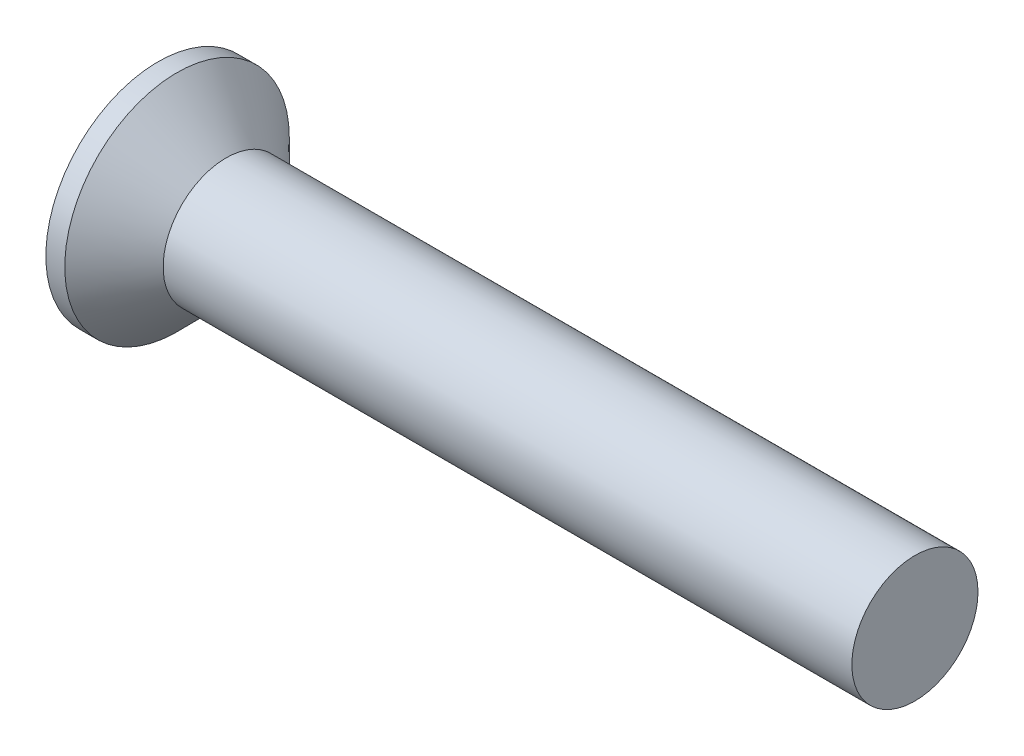
ISO-10303-21;
HEADER;
FILE_DESCRIPTION(('STEP AP214'),'2;1');
FILE_NAME('part.step','',(''),(''),'','','');
FILE_SCHEMA(('AUTOMOTIVE_DESIGN { 1 0 10303 214 1 1 1 1 }'));
ENDSEC;
DATA;
#1=APPLICATION_CONTEXT('core data for automotive mechanical design processes');
#2=APPLICATION_PROTOCOL_DEFINITION('international standard','automotive_design',2000,#1);
#3=PRODUCT_CONTEXT('',#1,'mechanical');
#4=PRODUCT('Part','Part','',(#3));
#5=PRODUCT_RELATED_PRODUCT_CATEGORY('part','',(#4));
#6=PRODUCT_DEFINITION_FORMATION('','',#4);
#7=PRODUCT_DEFINITION_CONTEXT('part definition',#1,'design');
#8=PRODUCT_DEFINITION('design','',#6,#7);
#9=PRODUCT_DEFINITION_SHAPE('','',#8);
#10=(LENGTH_UNIT() NAMED_UNIT(*) SI_UNIT(.MILLI.,.METRE.));
#11=(NAMED_UNIT(*) PLANE_ANGLE_UNIT() SI_UNIT($,.RADIAN.));
#12=(NAMED_UNIT(*) SI_UNIT($,.STERADIAN.) SOLID_ANGLE_UNIT());
#13=UNCERTAINTY_MEASURE_WITH_UNIT(LENGTH_MEASURE(1.E-05),#10,'distance_accuracy_value','');
#14=(GEOMETRIC_REPRESENTATION_CONTEXT(3) GLOBAL_UNCERTAINTY_ASSIGNED_CONTEXT((#13)) GLOBAL_UNIT_ASSIGNED_CONTEXT((#10,
#11,#12)) REPRESENTATION_CONTEXT('',''));
#15=CARTESIAN_POINT('',(0.,0.,0.));
#16=DIRECTION('',(0.,0.,1.));
#17=DIRECTION('',(1.,0.,0.));
#18=AXIS2_PLACEMENT_3D('',#15,#16,#17);
#19=CARTESIAN_POINT('',(0.,4.45,0.));
#20=DIRECTION('',(-1.,0.,0.));
#21=DIRECTION('',(0.,0.,1.));
#22=AXIS2_PLACEMENT_3D('',#19,#20,#21);
#23=PLANE('',#22);
#24=CARTESIAN_POINT('',(0.,0.,0.));
#25=DIRECTION('',(1.,0.,0.));
#26=DIRECTION('',(0.,0.,-1.));
#27=AXIS2_PLACEMENT_3D('',#24,#25,#26);
#28=CIRCLE('',#27,4.45);
#29=CARTESIAN_POINT('',(0.,0.,-4.45));
#30=VERTEX_POINT('',#29);
#31=EDGE_CURVE('E183',#30,#30,#28,.T.);
#32=ORIENTED_EDGE('',*,*,#31,.F.);
#33=EDGE_LOOP('',(#32));
#34=FACE_BOUND('',#33,.T.);
#35=DIRECTION('',(0.,1.,0.));
#36=VECTOR('',#35,1.);
#37=CARTESIAN_POINT('',(0.,-0.52,-0.52));
#38=LINE('',#37,#36);
#39=CARTESIAN_POINT('',(0.,-2.6,-0.52));
#40=VERTEX_POINT('',#39);
#41=CARTESIAN_POINT('',(0.,-0.82,-0.52));
#42=VERTEX_POINT('',#41);
#43=EDGE_CURVE('E287',#40,#42,#38,.T.);
#44=ORIENTED_EDGE('',*,*,#43,.T.);
#45=CARTESIAN_POINT('',(0.,-0.82,-0.82));
#46=DIRECTION('',(-1.,0.,0.));
#47=DIRECTION('',(0.,0.,1.));
#48=AXIS2_PLACEMENT_3D('',#45,#46,#47);
#49=CIRCLE('',#48,0.3);
#50=CARTESIAN_POINT('',(0.,-0.52,-0.82));
#51=VERTEX_POINT('',#50);
#52=EDGE_CURVE('E189',#42,#51,#49,.T.);
#53=ORIENTED_EDGE('',*,*,#52,.T.);
#54=DIRECTION('',(0.,0.,-1.));
#55=VECTOR('',#54,1.);
#56=CARTESIAN_POINT('',(0.,-0.52,-0.52));
#57=LINE('',#56,#55);
#58=CARTESIAN_POINT('',(0.,-0.52,-2.6));
#59=VERTEX_POINT('',#58);
#60=EDGE_CURVE('E282',#51,#59,#57,.T.);
#61=ORIENTED_EDGE('',*,*,#60,.T.);
#62=DIRECTION('',(0.,1.,0.));
#63=VECTOR('',#62,1.);
#64=CARTESIAN_POINT('',(0.,0.52,-2.6));
#65=LINE('',#64,#63);
#66=CARTESIAN_POINT('',(0.,0.52,-2.6));
#67=VERTEX_POINT('',#66);
#68=EDGE_CURVE('E246',#59,#67,#65,.T.);
#69=ORIENTED_EDGE('',*,*,#68,.T.);
#70=DIRECTION('',(0.,0.,1.));
#71=VECTOR('',#70,1.);
#72=CARTESIAN_POINT('',(0.,0.52,-0.52));
#73=LINE('',#72,#71);
#74=CARTESIAN_POINT('',(0.,0.52,-0.82));
#75=VERTEX_POINT('',#74);
#76=EDGE_CURVE('E236',#67,#75,#73,.T.);
#77=ORIENTED_EDGE('',*,*,#76,.T.);
#78=CARTESIAN_POINT('',(0.,0.82,-0.82));
#79=DIRECTION('',(-1.,0.,0.));
#80=DIRECTION('',(0.,0.,1.));
#81=AXIS2_PLACEMENT_3D('',#78,#79,#80);
#82=CIRCLE('',#81,0.3);
#83=CARTESIAN_POINT('',(0.,0.82,-0.52));
#84=VERTEX_POINT('',#83);
#85=EDGE_CURVE('E185',#75,#84,#82,.T.);
#86=ORIENTED_EDGE('',*,*,#85,.T.);
#87=DIRECTION('',(0.,1.,0.));
#88=VECTOR('',#87,1.);
#89=CARTESIAN_POINT('',(0.,0.52,-0.52));
#90=LINE('',#89,#88);
#91=CARTESIAN_POINT('',(0.,2.6,-0.52));
#92=VERTEX_POINT('',#91);
#93=EDGE_CURVE('E233',#84,#92,#90,.T.);
#94=ORIENTED_EDGE('',*,*,#93,.T.);
#95=DIRECTION('',(0.,0.,1.));
#96=VECTOR('',#95,1.);
#97=CARTESIAN_POINT('',(0.,2.6,-0.52));
#98=LINE('',#97,#96);
#99=CARTESIAN_POINT('',(0.,2.6,0.52));
#100=VERTEX_POINT('',#99);
#101=EDGE_CURVE('E242',#92,#100,#98,.T.);
#102=ORIENTED_EDGE('',*,*,#101,.T.);
#103=DIRECTION('',(0.,-1.,0.));
#104=VECTOR('',#103,1.);
#105=CARTESIAN_POINT('',(0.,0.52,0.52));
#106=LINE('',#105,#104);
#107=CARTESIAN_POINT('',(0.,0.82,0.52));
#108=VERTEX_POINT('',#107);
#109=EDGE_CURVE('E244',#100,#108,#106,.T.);
#110=ORIENTED_EDGE('',*,*,#109,.T.);
#111=CARTESIAN_POINT('',(0.,0.82,0.82));
#112=DIRECTION('',(-1.,0.,0.));
#113=DIRECTION('',(0.,0.,1.));
#114=AXIS2_PLACEMENT_3D('',#111,#112,#113);
#115=CIRCLE('',#114,0.3);
#116=CARTESIAN_POINT('',(0.,0.52,0.82));
#117=VERTEX_POINT('',#116);
#118=EDGE_CURVE('E155',#108,#117,#115,.T.);
#119=ORIENTED_EDGE('',*,*,#118,.T.);
#120=DIRECTION('',(0.,0.,1.));
#121=VECTOR('',#120,1.);
#122=CARTESIAN_POINT('',(0.,0.52,0.52));
#123=LINE('',#122,#121);
#124=CARTESIAN_POINT('',(0.,0.519999999999999,2.6));
#125=VERTEX_POINT('',#124);
#126=EDGE_CURVE('E149',#117,#125,#123,.T.);
#127=ORIENTED_EDGE('',*,*,#126,.T.);
#128=DIRECTION('',(0.,-1.,0.));
#129=VECTOR('',#128,1.);
#130=CARTESIAN_POINT('',(0.,0.519999999999999,2.6));
#131=LINE('',#130,#129);
#132=CARTESIAN_POINT('',(0.,-0.520000000000001,2.6));
#133=VERTEX_POINT('',#132);
#134=EDGE_CURVE('E153',#125,#133,#131,.T.);
#135=ORIENTED_EDGE('',*,*,#134,.T.);
#136=DIRECTION('',(0.,0.,-1.));
#137=VECTOR('',#136,1.);
#138=CARTESIAN_POINT('',(0.,-0.52,0.52));
#139=LINE('',#138,#137);
#140=CARTESIAN_POINT('',(0.,-0.52,0.82));
#141=VERTEX_POINT('',#140);
#142=EDGE_CURVE('E165',#133,#141,#139,.T.);
#143=ORIENTED_EDGE('',*,*,#142,.T.);
#144=CARTESIAN_POINT('',(0.,-0.82,0.819999999999999));
#145=DIRECTION('',(-1.,0.,0.));
#146=DIRECTION('',(0.,0.,1.));
#147=AXIS2_PLACEMENT_3D('',#144,#145,#146);
#148=CIRCLE('',#147,0.3);
#149=CARTESIAN_POINT('',(0.,-0.82,0.52));
#150=VERTEX_POINT('',#149);
#151=EDGE_CURVE('E187',#141,#150,#148,.T.);
#152=ORIENTED_EDGE('',*,*,#151,.T.);
#153=DIRECTION('',(0.,-1.,0.));
#154=VECTOR('',#153,1.);
#155=CARTESIAN_POINT('',(0.,-0.52,0.52));
#156=LINE('',#155,#154);
#157=CARTESIAN_POINT('',(0.,-2.6,0.519999999999999));
#158=VERTEX_POINT('',#157);
#159=EDGE_CURVE('E294',#150,#158,#156,.T.);
#160=ORIENTED_EDGE('',*,*,#159,.T.);
#161=DIRECTION('',(0.,0.,-1.));
#162=VECTOR('',#161,1.);
#163=CARTESIAN_POINT('',(0.,-2.6,-0.52));
#164=LINE('',#163,#162);
#165=EDGE_CURVE('E291',#158,#40,#164,.T.);
#166=ORIENTED_EDGE('',*,*,#165,.T.);
#167=EDGE_LOOP('',(#44,#53,#61,#69,#77,#86,#94,#102,#110,#119,#127,#135,#143,#152,#160,#166));
#168=FACE_BOUND('',#167,.T.);
#169=ADVANCED_FACE('F37',(#34,#168),#23,.T.);
#170=CARTESIAN_POINT('',(30.,2.5,0.));
#171=DIRECTION('',(1.,0.,0.));
#172=DIRECTION('',(0.,0.,-1.));
#173=AXIS2_PLACEMENT_3D('',#170,#171,#172);
#174=PLANE('',#173);
#175=CARTESIAN_POINT('',(30.,0.,0.));
#176=DIRECTION('',(1.,0.,0.));
#177=DIRECTION('',(0.,0.,-1.));
#178=AXIS2_PLACEMENT_3D('',#175,#176,#177);
#179=CIRCLE('',#178,2.5);
#180=CARTESIAN_POINT('',(30.,0.,-2.5));
#181=VERTEX_POINT('',#180);
#182=EDGE_CURVE('E170',#181,#181,#179,.T.);
#183=ORIENTED_EDGE('',*,*,#182,.T.);
#184=EDGE_LOOP('',(#183));
#185=FACE_BOUND('',#184,.T.);
#186=ADVANCED_FACE('F343',(#185),#174,.T.);
#187=CARTESIAN_POINT('',(4.51581291088132,0.,0.));
#188=DIRECTION('',(1.,0.,0.));
#189=DIRECTION('',(0.,0.,-1.));
#190=AXIS2_PLACEMENT_3D('',#187,#188,#189);
#191=CYLINDRICAL_SURFACE('',#190,4.45);
#192=ORIENTED_EDGE('',*,*,#31,.T.);
#193=EDGE_LOOP('',(#192));
#194=FACE_BOUND('',#193,.T.);
#195=CARTESIAN_POINT('',(0.750000000000007,0.,0.));
#196=DIRECTION('',(1.,0.,0.));
#197=DIRECTION('',(0.,0.,-1.));
#198=AXIS2_PLACEMENT_3D('',#195,#196,#197);
#199=CIRCLE('',#198,4.45);
#200=CARTESIAN_POINT('',(0.750000000000007,0.,-4.45));
#201=VERTEX_POINT('',#200);
#202=EDGE_CURVE('E253',#201,#201,#199,.T.);
#203=ORIENTED_EDGE('',*,*,#202,.F.);
#204=EDGE_LOOP('',(#203));
#205=FACE_BOUND('',#204,.T.);
#206=ADVANCED_FACE('F349',(#194,#205),#191,.T.);
#207=CARTESIAN_POINT('',(2.7,0.,0.));
#208=DIRECTION('',(-1.,0.,0.));
#209=DIRECTION('',(0.,0.,1.));
#210=AXIS2_PLACEMENT_3D('',#207,#208,#209);
#211=CONICAL_SURFACE('',#210,2.5,0.78539816339745);
#212=ORIENTED_EDGE('',*,*,#202,.T.);
#213=EDGE_LOOP('',(#212));
#214=FACE_BOUND('',#213,.T.);
#215=CARTESIAN_POINT('',(2.7,0.,0.));
#216=DIRECTION('',(1.,0.,0.));
#217=DIRECTION('',(0.,0.,-1.));
#218=AXIS2_PLACEMENT_3D('',#215,#216,#217);
#219=CIRCLE('',#218,2.5);
#220=CARTESIAN_POINT('',(2.7,0.,-2.5));
#221=VERTEX_POINT('',#220);
#222=EDGE_CURVE('E173',#221,#221,#219,.T.);
#223=ORIENTED_EDGE('',*,*,#222,.F.);
#224=EDGE_LOOP('',(#223));
#225=FACE_BOUND('',#224,.T.);
#226=ADVANCED_FACE('F489',(#214,#225),#211,.T.);
#227=CARTESIAN_POINT('',(4.51581291088132,0.,0.));
#228=DIRECTION('',(1.,0.,0.));
#229=DIRECTION('',(0.,0.,-1.));
#230=AXIS2_PLACEMENT_3D('',#227,#228,#229);
#231=CYLINDRICAL_SURFACE('',#230,2.5);
#232=ORIENTED_EDGE('',*,*,#182,.F.);
#233=EDGE_LOOP('',(#232));
#234=FACE_BOUND('',#233,.T.);
#235=ORIENTED_EDGE('',*,*,#222,.T.);
#236=EDGE_LOOP('',(#235));
#237=FACE_BOUND('',#236,.T.);
#238=ADVANCED_FACE('F459',(#234,#237),#231,.T.);
#239=CARTESIAN_POINT('',(1.35,0.52,0.52));
#240=DIRECTION('',(0.,-1.,0.));
#241=DIRECTION('',(0.,0.,-1.));
#242=AXIS2_PLACEMENT_3D('',#239,#240,#241);
#243=PLANE('',#242);
#244=ORIENTED_EDGE('',*,*,#126,.F.);
#245=DIRECTION('',(-1.,0.,0.));
#246=VECTOR('',#245,1.);
#247=CARTESIAN_POINT('',(1.35,0.52,0.82));
#248=LINE('',#247,#246);
#249=CARTESIAN_POINT('',(1.35,0.52,0.82));
#250=VERTEX_POINT('',#249);
#251=EDGE_CURVE('E52',#117,#250,#248,.F.);
#252=ORIENTED_EDGE('',*,*,#251,.T.);
#253=DIRECTION('',(0.,0.,1.));
#254=VECTOR('',#253,1.);
#255=CARTESIAN_POINT('',(1.35,0.52,0.52));
#256=LINE('',#255,#254);
#257=CARTESIAN_POINT('',(1.35,0.52,1.820577136594));
#258=VERTEX_POINT('',#257);
#259=EDGE_CURVE('E168',#250,#258,#256,.T.);
#260=ORIENTED_EDGE('',*,*,#259,.T.);
#261=DIRECTION('',(-0.866025403784438,0.,0.500000000000001));
#262=VECTOR('',#261,1.);
#263=CARTESIAN_POINT('',(0.,0.519999999999999,2.6));
#264=LINE('',#263,#262);
#265=EDGE_CURVE('E161',#258,#125,#264,.T.);
#266=ORIENTED_EDGE('',*,*,#265,.T.);
#267=EDGE_LOOP('',(#244,#252,#260,#266));
#268=FACE_BOUND('',#267,.T.);
#269=ADVANCED_FACE('F167',(#268),#243,.T.);
#270=CARTESIAN_POINT('',(0.,0.519999999999999,2.6));
#271=DIRECTION('',(-0.500000000000001,0.,-0.866025403784438));
#272=DIRECTION('',(-0.866025403784438,0.,0.500000000000001));
#273=AXIS2_PLACEMENT_3D('',#270,#271,#272);
#274=PLANE('',#273);
#275=ORIENTED_EDGE('',*,*,#134,.F.);
#276=ORIENTED_EDGE('',*,*,#265,.F.);
#277=DIRECTION('',(0.,-1.,0.));
#278=VECTOR('',#277,1.);
#279=CARTESIAN_POINT('',(1.35,0.52,1.820577136594));
#280=LINE('',#279,#278);
#281=CARTESIAN_POINT('',(1.35,-0.52,1.820577136594));
#282=VERTEX_POINT('',#281);
#283=EDGE_CURVE('E179',#258,#282,#280,.T.);
#284=ORIENTED_EDGE('',*,*,#283,.T.);
#285=DIRECTION('',(-0.866025403784438,0.,0.500000000000001));
#286=VECTOR('',#285,1.);
#287=CARTESIAN_POINT('',(1.91316641993582,-0.52,1.4954328524455));
#288=LINE('',#287,#286);
#289=EDGE_CURVE('E163',#282,#133,#288,.T.);
#290=ORIENTED_EDGE('',*,*,#289,.T.);
#291=EDGE_LOOP('',(#275,#276,#284,#290));
#292=FACE_BOUND('',#291,.T.);
#293=ADVANCED_FACE('F160',(#292),#274,.T.);
#294=CARTESIAN_POINT('',(1.35,-0.52,0.52));
#295=DIRECTION('',(0.,1.,0.));
#296=DIRECTION('',(0.,0.,1.));
#297=AXIS2_PLACEMENT_3D('',#294,#295,#296);
#298=PLANE('',#297);
#299=DIRECTION('',(0.,0.,-1.));
#300=VECTOR('',#299,1.);
#301=CARTESIAN_POINT('',(1.35,-0.52,0.52));
#302=LINE('',#301,#300);
#303=CARTESIAN_POINT('',(1.35,-0.52,0.82));
#304=VERTEX_POINT('',#303);
#305=EDGE_CURVE('E303',#282,#304,#302,.T.);
#306=ORIENTED_EDGE('',*,*,#305,.T.);
#307=DIRECTION('',(-1.,0.,0.));
#308=VECTOR('',#307,1.);
#309=CARTESIAN_POINT('',(1.35,-0.52,0.82));
#310=LINE('',#309,#308);
#311=EDGE_CURVE('E193',#304,#141,#310,.T.);
#312=ORIENTED_EDGE('',*,*,#311,.T.);
#313=ORIENTED_EDGE('',*,*,#142,.F.);
#314=ORIENTED_EDGE('',*,*,#289,.F.);
#315=EDGE_LOOP('',(#306,#312,#313,#314));
#316=FACE_BOUND('',#315,.T.);
#317=ADVANCED_FACE('F308',(#316),#298,.T.);
#318=CARTESIAN_POINT('',(1.35,-0.52,0.52));
#319=DIRECTION('',(0.,0.,-1.));
#320=DIRECTION('',(0.,1.,0.));
#321=AXIS2_PLACEMENT_3D('',#318,#319,#320);
#322=PLANE('',#321);
#323=ORIENTED_EDGE('',*,*,#159,.F.);
#324=DIRECTION('',(-1.,0.,0.));
#325=VECTOR('',#324,1.);
#326=CARTESIAN_POINT('',(1.35,-0.82,0.52));
#327=LINE('',#326,#325);
#328=CARTESIAN_POINT('',(1.35,-0.82,0.52));
#329=VERTEX_POINT('',#328);
#330=EDGE_CURVE('E196',#150,#329,#327,.F.);
#331=ORIENTED_EDGE('',*,*,#330,.T.);
#332=DIRECTION('',(0.,-1.,0.));
#333=VECTOR('',#332,1.);
#334=CARTESIAN_POINT('',(1.35,-0.52,0.52));
#335=LINE('',#334,#333);
#336=CARTESIAN_POINT('',(1.35,-1.820577136594,0.519999999999999));
#337=VERTEX_POINT('',#336);
#338=EDGE_CURVE('E264',#329,#337,#335,.T.);
#339=ORIENTED_EDGE('',*,*,#338,.T.);
#340=DIRECTION('',(-0.866025403784438,-0.500000000000001,0.));
#341=VECTOR('',#340,1.);
#342=CARTESIAN_POINT('',(0.,-2.6,0.519999999999999));
#343=LINE('',#342,#341);
#344=EDGE_CURVE('E175',#337,#158,#343,.T.);
#345=ORIENTED_EDGE('',*,*,#344,.T.);
#346=EDGE_LOOP('',(#323,#331,#339,#345));
#347=FACE_BOUND('',#346,.T.);
#348=ADVANCED_FACE('F318',(#347),#322,.T.);
#349=CARTESIAN_POINT('',(0.,-2.6,-0.52));
#350=DIRECTION('',(-0.500000000000001,0.866025403784438,0.));
#351=DIRECTION('',(-0.866025403784438,-0.500000000000001,0.));
#352=AXIS2_PLACEMENT_3D('',#349,#350,#351);
#353=PLANE('',#352);
#354=ORIENTED_EDGE('',*,*,#165,.F.);
#355=ORIENTED_EDGE('',*,*,#344,.F.);
#356=DIRECTION('',(0.,0.,-1.));
#357=VECTOR('',#356,1.);
#358=CARTESIAN_POINT('',(1.35,-1.820577136594,-0.52));
#359=LINE('',#358,#357);
#360=CARTESIAN_POINT('',(1.35,-1.820577136594,-0.52));
#361=VERTEX_POINT('',#360);
#362=EDGE_CURVE('E261',#337,#361,#359,.T.);
#363=ORIENTED_EDGE('',*,*,#362,.T.);
#364=DIRECTION('',(-0.866025403784438,-0.500000000000001,0.));
#365=VECTOR('',#364,1.);
#366=CARTESIAN_POINT('',(1.91316641993582,-1.4954328524455,-0.52));
#367=LINE('',#366,#365);
#368=EDGE_CURVE('E258',#361,#40,#367,.T.);
#369=ORIENTED_EDGE('',*,*,#368,.T.);
#370=EDGE_LOOP('',(#354,#355,#363,#369));
#371=FACE_BOUND('',#370,.T.);
#372=ADVANCED_FACE('F322',(#371),#353,.T.);
#373=CARTESIAN_POINT('',(1.35,-0.52,-0.52));
#374=DIRECTION('',(0.,0.,1.));
#375=DIRECTION('',(1.,0.,0.));
#376=AXIS2_PLACEMENT_3D('',#373,#374,#375);
#377=PLANE('',#376);
#378=DIRECTION('',(0.,1.,0.));
#379=VECTOR('',#378,1.);
#380=CARTESIAN_POINT('',(1.35,-0.52,-0.52));
#381=LINE('',#380,#379);
#382=CARTESIAN_POINT('',(1.35,-0.82,-0.52));
#383=VERTEX_POINT('',#382);
#384=EDGE_CURVE('E263',#361,#383,#381,.T.);
#385=ORIENTED_EDGE('',*,*,#384,.T.);
#386=DIRECTION('',(-1.,0.,0.));
#387=VECTOR('',#386,1.);
#388=CARTESIAN_POINT('',(1.35,-0.82,-0.52));
#389=LINE('',#388,#387);
#390=EDGE_CURVE('E180',#383,#42,#389,.T.);
#391=ORIENTED_EDGE('',*,*,#390,.T.);
#392=ORIENTED_EDGE('',*,*,#43,.F.);
#393=ORIENTED_EDGE('',*,*,#368,.F.);
#394=EDGE_LOOP('',(#385,#391,#392,#393));
#395=FACE_BOUND('',#394,.T.);
#396=ADVANCED_FACE('F326',(#395),#377,.T.);
#397=CARTESIAN_POINT('',(1.35,-0.52,-0.52));
#398=DIRECTION('',(0.,1.,0.));
#399=DIRECTION('',(0.,0.,1.));
#400=AXIS2_PLACEMENT_3D('',#397,#398,#399);
#401=PLANE('',#400);
#402=ORIENTED_EDGE('',*,*,#60,.F.);
#403=DIRECTION('',(-1.,0.,0.));
#404=VECTOR('',#403,1.);
#405=CARTESIAN_POINT('',(1.35,-0.52,-0.82));
#406=LINE('',#405,#404);
#407=CARTESIAN_POINT('',(1.35,-0.52,-0.82));
#408=VERTEX_POINT('',#407);
#409=EDGE_CURVE('E191',#51,#408,#406,.F.);
#410=ORIENTED_EDGE('',*,*,#409,.T.);
#411=DIRECTION('',(0.,0.,-1.));
#412=VECTOR('',#411,1.);
#413=CARTESIAN_POINT('',(1.35,-0.52,-0.52));
#414=LINE('',#413,#412);
#415=CARTESIAN_POINT('',(1.35,-0.52,-1.820577136594));
#416=VERTEX_POINT('',#415);
#417=EDGE_CURVE('E275',#408,#416,#414,.T.);
#418=ORIENTED_EDGE('',*,*,#417,.T.);
#419=DIRECTION('',(-0.866025403784438,0.,-0.500000000000001));
#420=VECTOR('',#419,1.);
#421=CARTESIAN_POINT('',(0.,-0.52,-2.6));
#422=LINE('',#421,#420);
#423=EDGE_CURVE('E260',#416,#59,#422,.T.);
#424=ORIENTED_EDGE('',*,*,#423,.T.);
#425=EDGE_LOOP('',(#402,#410,#418,#424));
#426=FACE_BOUND('',#425,.T.);
#427=ADVANCED_FACE('F281',(#426),#401,.T.);
#428=CARTESIAN_POINT('',(0.,0.52,-2.6));
#429=DIRECTION('',(-0.500000000000001,0.,0.866025403784438));
#430=DIRECTION('',(0.866025403784438,0.,0.500000000000001));
#431=AXIS2_PLACEMENT_3D('',#428,#429,#430);
#432=PLANE('',#431);
#433=ORIENTED_EDGE('',*,*,#68,.F.);
#434=ORIENTED_EDGE('',*,*,#423,.F.);
#435=DIRECTION('',(0.,1.,0.));
#436=VECTOR('',#435,1.);
#437=CARTESIAN_POINT('',(1.35,0.52,-1.820577136594));
#438=LINE('',#437,#436);
#439=CARTESIAN_POINT('',(1.35,0.52,-1.820577136594));
#440=VERTEX_POINT('',#439);
#441=EDGE_CURVE('E228',#416,#440,#438,.T.);
#442=ORIENTED_EDGE('',*,*,#441,.T.);
#443=DIRECTION('',(-0.866025403784438,0.,-0.500000000000001));
#444=VECTOR('',#443,1.);
#445=CARTESIAN_POINT('',(1.91316641993582,0.52,-1.4954328524455));
#446=LINE('',#445,#444);
#447=EDGE_CURVE('E227',#440,#67,#446,.T.);
#448=ORIENTED_EDGE('',*,*,#447,.T.);
#449=EDGE_LOOP('',(#433,#434,#442,#448));
#450=FACE_BOUND('',#449,.T.);
#451=ADVANCED_FACE('F286',(#450),#432,.T.);
#452=CARTESIAN_POINT('',(1.35,0.52,-0.52));
#453=DIRECTION('',(0.,-1.,0.));
#454=DIRECTION('',(0.,0.,-1.));
#455=AXIS2_PLACEMENT_3D('',#452,#453,#454);
#456=PLANE('',#455);
#457=DIRECTION('',(0.,0.,1.));
#458=VECTOR('',#457,1.);
#459=CARTESIAN_POINT('',(1.35,0.52,-0.52));
#460=LINE('',#459,#458);
#461=CARTESIAN_POINT('',(1.35,0.52,-0.82));
#462=VERTEX_POINT('',#461);
#463=EDGE_CURVE('E216',#440,#462,#460,.T.);
#464=ORIENTED_EDGE('',*,*,#463,.T.);
#465=DIRECTION('',(-1.,0.,0.));
#466=VECTOR('',#465,1.);
#467=CARTESIAN_POINT('',(1.35,0.52,-0.82));
#468=LINE('',#467,#466);
#469=EDGE_CURVE('E198',#462,#75,#468,.T.);
#470=ORIENTED_EDGE('',*,*,#469,.T.);
#471=ORIENTED_EDGE('',*,*,#76,.F.);
#472=ORIENTED_EDGE('',*,*,#447,.F.);
#473=EDGE_LOOP('',(#464,#470,#471,#472));
#474=FACE_BOUND('',#473,.T.);
#475=ADVANCED_FACE('F224',(#474),#456,.T.);
#476=CARTESIAN_POINT('',(1.35,0.52,-0.52));
#477=DIRECTION('',(0.,0.,1.));
#478=DIRECTION('',(1.,0.,0.));
#479=AXIS2_PLACEMENT_3D('',#476,#477,#478);
#480=PLANE('',#479);
#481=ORIENTED_EDGE('',*,*,#93,.F.);
#482=DIRECTION('',(-1.,0.,0.));
#483=VECTOR('',#482,1.);
#484=CARTESIAN_POINT('',(1.35,0.82,-0.52));
#485=LINE('',#484,#483);
#486=CARTESIAN_POINT('',(1.35,0.82,-0.52));
#487=VERTEX_POINT('',#486);
#488=EDGE_CURVE('E201',#84,#487,#485,.F.);
#489=ORIENTED_EDGE('',*,*,#488,.T.);
#490=DIRECTION('',(0.,1.,0.));
#491=VECTOR('',#490,1.);
#492=CARTESIAN_POINT('',(1.35,0.52,-0.52));
#493=LINE('',#492,#491);
#494=CARTESIAN_POINT('',(1.35,1.820577136594,-0.52));
#495=VERTEX_POINT('',#494);
#496=EDGE_CURVE('E218',#487,#495,#493,.T.);
#497=ORIENTED_EDGE('',*,*,#496,.T.);
#498=DIRECTION('',(-0.866025403784438,0.500000000000001,0.));
#499=VECTOR('',#498,1.);
#500=CARTESIAN_POINT('',(0.,2.6,-0.52));
#501=LINE('',#500,#499);
#502=EDGE_CURVE('E240',#495,#92,#501,.T.);
#503=ORIENTED_EDGE('',*,*,#502,.T.);
#504=EDGE_LOOP('',(#481,#489,#497,#503));
#505=FACE_BOUND('',#504,.T.);
#506=ADVANCED_FACE('F238',(#505),#480,.T.);
#507=CARTESIAN_POINT('',(0.,2.6,-0.52));
#508=DIRECTION('',(-0.500000000000001,-0.866025403784438,0.));
#509=DIRECTION('',(0.866025403784438,-0.500000000000001,0.));
#510=AXIS2_PLACEMENT_3D('',#507,#508,#509);
#511=PLANE('',#510);
#512=ORIENTED_EDGE('',*,*,#101,.F.);
#513=ORIENTED_EDGE('',*,*,#502,.F.);
#514=DIRECTION('',(0.,0.,1.));
#515=VECTOR('',#514,1.);
#516=CARTESIAN_POINT('',(1.35,1.820577136594,-0.52));
#517=LINE('',#516,#515);
#518=CARTESIAN_POINT('',(1.35,1.820577136594,0.52));
#519=VERTEX_POINT('',#518);
#520=EDGE_CURVE('E270',#495,#519,#517,.T.);
#521=ORIENTED_EDGE('',*,*,#520,.T.);
#522=DIRECTION('',(-0.866025403784438,0.500000000000001,0.));
#523=VECTOR('',#522,1.);
#524=CARTESIAN_POINT('',(1.91316641993582,1.4954328524455,0.52));
#525=LINE('',#524,#523);
#526=EDGE_CURVE('E267',#519,#100,#525,.T.);
#527=ORIENTED_EDGE('',*,*,#526,.T.);
#528=EDGE_LOOP('',(#512,#513,#521,#527));
#529=FACE_BOUND('',#528,.T.);
#530=ADVANCED_FACE('F361',(#529),#511,.T.);
#531=CARTESIAN_POINT('',(1.35,0.52,0.52));
#532=DIRECTION('',(0.,0.,-1.));
#533=DIRECTION('',(0.,1.,0.));
#534=AXIS2_PLACEMENT_3D('',#531,#532,#533);
#535=PLANE('',#534);
#536=DIRECTION('',(0.,-1.,0.));
#537=VECTOR('',#536,1.);
#538=CARTESIAN_POINT('',(1.35,0.52,0.52));
#539=LINE('',#538,#537);
#540=CARTESIAN_POINT('',(1.35,0.82,0.52));
#541=VERTEX_POINT('',#540);
#542=EDGE_CURVE('E269',#519,#541,#539,.T.);
#543=ORIENTED_EDGE('',*,*,#542,.T.);
#544=DIRECTION('',(-1.,0.,0.));
#545=VECTOR('',#544,1.);
#546=CARTESIAN_POINT('',(1.35,0.82,0.52));
#547=LINE('',#546,#545);
#548=EDGE_CURVE('E203',#541,#108,#547,.T.);
#549=ORIENTED_EDGE('',*,*,#548,.T.);
#550=ORIENTED_EDGE('',*,*,#109,.F.);
#551=ORIENTED_EDGE('',*,*,#526,.F.);
#552=EDGE_LOOP('',(#543,#549,#550,#551));
#553=FACE_BOUND('',#552,.T.);
#554=ADVANCED_FACE('F339',(#553),#535,.T.);
#555=CARTESIAN_POINT('',(1.35,0.52,0.52));
#556=DIRECTION('',(1.,0.,0.));
#557=DIRECTION('',(0.,0.,-1.));
#558=AXIS2_PLACEMENT_3D('',#555,#556,#557);
#559=PLANE('',#558);
#560=ORIENTED_EDGE('',*,*,#259,.F.);
#561=CARTESIAN_POINT('',(1.35,0.82,0.82));
#562=DIRECTION('',(1.,0.,0.));
#563=DIRECTION('',(0.,0.,-1.));
#564=AXIS2_PLACEMENT_3D('',#561,#562,#563);
#565=CIRCLE('',#564,0.3);
#566=EDGE_CURVE('E11',#250,#541,#565,.T.);
#567=ORIENTED_EDGE('',*,*,#566,.T.);
#568=ORIENTED_EDGE('',*,*,#542,.F.);
#569=ORIENTED_EDGE('',*,*,#520,.F.);
#570=ORIENTED_EDGE('',*,*,#496,.F.);
#571=CARTESIAN_POINT('',(1.35,0.82,-0.82));
#572=DIRECTION('',(1.,0.,0.));
#573=DIRECTION('',(0.,0.,-1.));
#574=AXIS2_PLACEMENT_3D('',#571,#572,#573);
#575=CIRCLE('',#574,0.3);
#576=EDGE_CURVE('E45',#487,#462,#575,.T.);
#577=ORIENTED_EDGE('',*,*,#576,.T.);
#578=ORIENTED_EDGE('',*,*,#463,.F.);
#579=ORIENTED_EDGE('',*,*,#441,.F.);
#580=ORIENTED_EDGE('',*,*,#417,.F.);
#581=CARTESIAN_POINT('',(1.35,-0.82,-0.82));
#582=DIRECTION('',(1.,0.,0.));
#583=DIRECTION('',(0.,0.,-1.));
#584=AXIS2_PLACEMENT_3D('',#581,#582,#583);
#585=CIRCLE('',#584,0.3);
#586=EDGE_CURVE('E207',#408,#383,#585,.T.);
#587=ORIENTED_EDGE('',*,*,#586,.T.);
#588=ORIENTED_EDGE('',*,*,#384,.F.);
#589=ORIENTED_EDGE('',*,*,#362,.F.);
#590=ORIENTED_EDGE('',*,*,#338,.F.);
#591=CARTESIAN_POINT('',(1.35,-0.82,0.819999999999999));
#592=DIRECTION('',(1.,0.,0.));
#593=DIRECTION('',(0.,0.,-1.));
#594=AXIS2_PLACEMENT_3D('',#591,#592,#593);
#595=CIRCLE('',#594,0.3);
#596=EDGE_CURVE('E209',#329,#304,#595,.T.);
#597=ORIENTED_EDGE('',*,*,#596,.T.);
#598=ORIENTED_EDGE('',*,*,#305,.F.);
#599=ORIENTED_EDGE('',*,*,#283,.F.);
#600=EDGE_LOOP('',(#560,#567,#568,#569,#570,#577,#578,#579,#580,#587,#588,#589,#590,#597,#598,#599));
#601=FACE_BOUND('',#600,.T.);
#602=ADVANCED_FACE('F214',(#601),#559,.F.);
#603=CARTESIAN_POINT('',(1.35,-0.82,-0.82));
#604=DIRECTION('',(-1.,0.,0.));
#605=DIRECTION('',(0.,0.,1.));
#606=AXIS2_PLACEMENT_3D('',#603,#604,#605);
#607=CYLINDRICAL_SURFACE('',#606,0.3);
#608=ORIENTED_EDGE('',*,*,#586,.F.);
#609=ORIENTED_EDGE('',*,*,#409,.F.);
#610=ORIENTED_EDGE('',*,*,#52,.F.);
#611=ORIENTED_EDGE('',*,*,#390,.F.);
#612=EDGE_LOOP('',(#608,#609,#610,#611));
#613=FACE_BOUND('',#612,.T.);
#614=ADVANCED_FACE('F331',(#613),#607,.T.);
#615=CARTESIAN_POINT('',(1.35,-0.82,0.819999999999999));
#616=DIRECTION('',(-1.,0.,0.));
#617=DIRECTION('',(0.,0.,1.));
#618=AXIS2_PLACEMENT_3D('',#615,#616,#617);
#619=CYLINDRICAL_SURFACE('',#618,0.3);
#620=ORIENTED_EDGE('',*,*,#596,.F.);
#621=ORIENTED_EDGE('',*,*,#330,.F.);
#622=ORIENTED_EDGE('',*,*,#151,.F.);
#623=ORIENTED_EDGE('',*,*,#311,.F.);
#624=EDGE_LOOP('',(#620,#621,#622,#623));
#625=FACE_BOUND('',#624,.T.);
#626=ADVANCED_FACE('F315',(#625),#619,.T.);
#627=CARTESIAN_POINT('',(1.35,0.82,-0.82));
#628=DIRECTION('',(-1.,0.,0.));
#629=DIRECTION('',(0.,0.,1.));
#630=AXIS2_PLACEMENT_3D('',#627,#628,#629);
#631=CYLINDRICAL_SURFACE('',#630,0.3);
#632=ORIENTED_EDGE('',*,*,#576,.F.);
#633=ORIENTED_EDGE('',*,*,#488,.F.);
#634=ORIENTED_EDGE('',*,*,#85,.F.);
#635=ORIENTED_EDGE('',*,*,#469,.F.);
#636=EDGE_LOOP('',(#632,#633,#634,#635));
#637=FACE_BOUND('',#636,.T.);
#638=ADVANCED_FACE('F230',(#637),#631,.T.);
#639=CARTESIAN_POINT('',(1.35,0.82,0.82));
#640=DIRECTION('',(-1.,0.,0.));
#641=DIRECTION('',(0.,0.,1.));
#642=AXIS2_PLACEMENT_3D('',#639,#640,#641);
#643=CYLINDRICAL_SURFACE('',#642,0.3);
#644=ORIENTED_EDGE('',*,*,#566,.F.);
#645=ORIENTED_EDGE('',*,*,#251,.F.);
#646=ORIENTED_EDGE('',*,*,#118,.F.);
#647=ORIENTED_EDGE('',*,*,#548,.F.);
#648=EDGE_LOOP('',(#644,#645,#646,#647));
#649=FACE_BOUND('',#648,.T.);
#650=ADVANCED_FACE('F39',(#649),#643,.T.);
#651=CLOSED_SHELL('',(#169,#186,#206,#226,#238,#269,#293,#317,#348,#372,#396,#427,#451,#475,
#506,#530,#554,#602,#614,#626,#638,#650));
#652=MANIFOLD_SOLID_BREP('B2',#651);
#653=ADVANCED_BREP_SHAPE_REPRESENTATION('',(#18,#652),#14);
#654=SHAPE_DEFINITION_REPRESENTATION(#9,#653);
ENDSEC;
END-ISO-10303-21;
